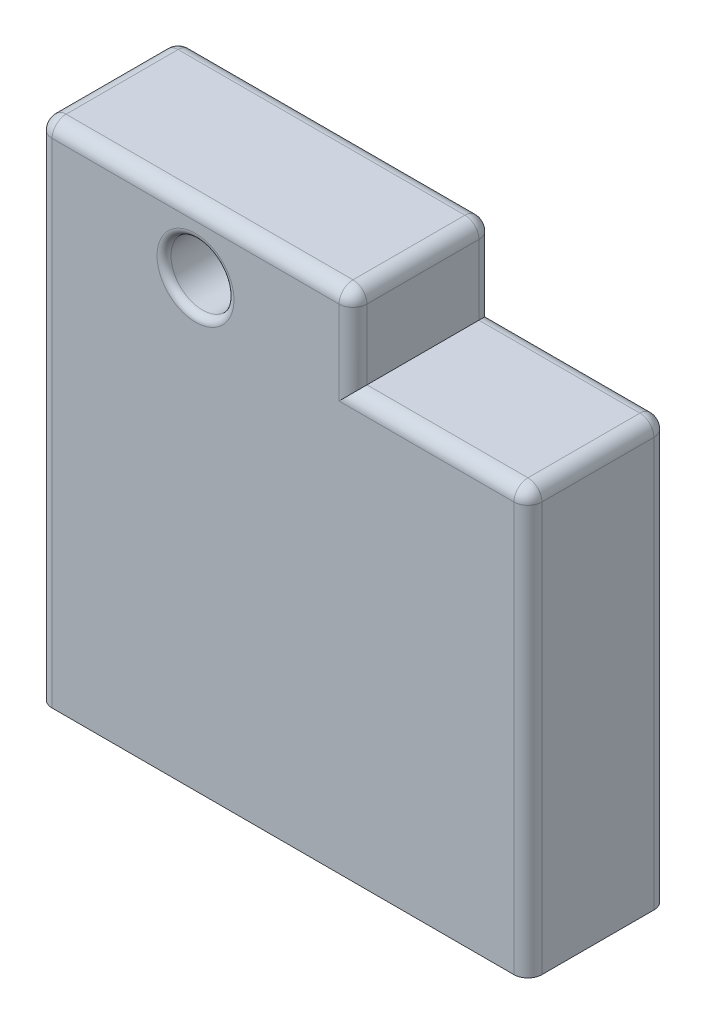
ISO-10303-21;
HEADER;
FILE_DESCRIPTION(('STEP AP214'),'2;1');
FILE_NAME('part.step','',(''),(''),'','','');
FILE_SCHEMA(('AUTOMOTIVE_DESIGN { 1 0 10303 214 1 1 1 1 }'));
ENDSEC;
DATA;
#1=APPLICATION_CONTEXT('core data for automotive mechanical design processes');
#2=APPLICATION_PROTOCOL_DEFINITION('international standard','automotive_design',2000,#1);
#3=PRODUCT_CONTEXT('',#1,'mechanical');
#4=PRODUCT('Part','Part','',(#3));
#5=PRODUCT_RELATED_PRODUCT_CATEGORY('part','',(#4));
#6=PRODUCT_DEFINITION_FORMATION('','',#4);
#7=PRODUCT_DEFINITION_CONTEXT('part definition',#1,'design');
#8=PRODUCT_DEFINITION('design','',#6,#7);
#9=PRODUCT_DEFINITION_SHAPE('','',#8);
#10=(LENGTH_UNIT() NAMED_UNIT(*) SI_UNIT(.MILLI.,.METRE.));
#11=(NAMED_UNIT(*) PLANE_ANGLE_UNIT() SI_UNIT($,.RADIAN.));
#12=(NAMED_UNIT(*) SI_UNIT($,.STERADIAN.) SOLID_ANGLE_UNIT());
#13=UNCERTAINTY_MEASURE_WITH_UNIT(LENGTH_MEASURE(1.E-05),#10,'distance_accuracy_value','');
#14=(GEOMETRIC_REPRESENTATION_CONTEXT(3) GLOBAL_UNCERTAINTY_ASSIGNED_CONTEXT((#13)) GLOBAL_UNIT_ASSIGNED_CONTEXT((#10,
#11,#12)) REPRESENTATION_CONTEXT('',''));
#15=CARTESIAN_POINT('',(0.,0.,0.));
#16=DIRECTION('',(0.,0.,1.));
#17=DIRECTION('',(1.,0.,0.));
#18=AXIS2_PLACEMENT_3D('',#15,#16,#17);
#19=CARTESIAN_POINT('',(88.9,0.,25.4));
#20=DIRECTION('',(0.,1.,0.));
#21=DIRECTION('',(0.,0.,1.));
#22=AXIS2_PLACEMENT_3D('',#19,#20,#21);
#23=PLANE('',#22);
#24=DIRECTION('',(1.,0.,0.));
#25=VECTOR('',#24,1.);
#26=CARTESIAN_POINT('',(88.9,0.,25.4));
#27=LINE('',#26,#25);
#28=CARTESIAN_POINT('',(2.54,0.,25.4));
#29=VERTEX_POINT('',#28);
#30=CARTESIAN_POINT('',(86.36,0.,25.4));
#31=VERTEX_POINT('',#30);
#32=EDGE_CURVE('E157',#29,#31,#27,.T.);
#33=ORIENTED_EDGE('',*,*,#32,.F.);
#34=CARTESIAN_POINT('',(2.54,0.,22.86));
#35=DIRECTION('',(0.,1.,0.));
#36=DIRECTION('',(0.,0.,1.));
#37=AXIS2_PLACEMENT_3D('',#34,#35,#36);
#38=CIRCLE('',#37,2.54);
#39=CARTESIAN_POINT('',(0.,0.,22.86));
#40=VERTEX_POINT('',#39);
#41=EDGE_CURVE('E169',#29,#40,#38,.F.);
#42=ORIENTED_EDGE('',*,*,#41,.T.);
#43=DIRECTION('',(0.,0.,-1.));
#44=VECTOR('',#43,1.);
#45=CARTESIAN_POINT('',(0.,0.,25.4));
#46=LINE('',#45,#44);
#47=CARTESIAN_POINT('',(0.,0.,2.54));
#48=VERTEX_POINT('',#47);
#49=EDGE_CURVE('E175',#40,#48,#46,.T.);
#50=ORIENTED_EDGE('',*,*,#49,.T.);
#51=CARTESIAN_POINT('',(2.54,0.,2.54));
#52=DIRECTION('',(0.,1.,0.));
#53=DIRECTION('',(0.,0.,1.));
#54=AXIS2_PLACEMENT_3D('',#51,#52,#53);
#55=CIRCLE('',#54,2.54);
#56=CARTESIAN_POINT('',(2.54,0.,0.));
#57=VERTEX_POINT('',#56);
#58=EDGE_CURVE('E183',#48,#57,#55,.F.);
#59=ORIENTED_EDGE('',*,*,#58,.T.);
#60=DIRECTION('',(1.,0.,0.));
#61=VECTOR('',#60,1.);
#62=CARTESIAN_POINT('',(88.9,0.,0.));
#63=LINE('',#62,#61);
#64=CARTESIAN_POINT('',(86.36,0.,0.));
#65=VERTEX_POINT('',#64);
#66=EDGE_CURVE('E176',#57,#65,#63,.T.);
#67=ORIENTED_EDGE('',*,*,#66,.T.);
#68=CARTESIAN_POINT('',(86.36,0.,2.54));
#69=DIRECTION('',(0.,1.,0.));
#70=DIRECTION('',(0.,0.,1.));
#71=AXIS2_PLACEMENT_3D('',#68,#69,#70);
#72=CIRCLE('',#71,2.54);
#73=CARTESIAN_POINT('',(88.9,0.,2.54));
#74=VERTEX_POINT('',#73);
#75=EDGE_CURVE('E189',#65,#74,#72,.F.);
#76=ORIENTED_EDGE('',*,*,#75,.T.);
#77=DIRECTION('',(0.,0.,-1.));
#78=VECTOR('',#77,1.);
#79=CARTESIAN_POINT('',(88.9,0.,25.4));
#80=LINE('',#79,#78);
#81=CARTESIAN_POINT('',(88.9,0.,22.86));
#82=VERTEX_POINT('',#81);
#83=EDGE_CURVE('E374',#82,#74,#80,.T.);
#84=ORIENTED_EDGE('',*,*,#83,.F.);
#85=CARTESIAN_POINT('',(86.36,0.,22.86));
#86=DIRECTION('',(0.,1.,0.));
#87=DIRECTION('',(0.,0.,1.));
#88=AXIS2_PLACEMENT_3D('',#85,#86,#87);
#89=CIRCLE('',#88,2.54);
#90=EDGE_CURVE('E173',#82,#31,#89,.F.);
#91=ORIENTED_EDGE('',*,*,#90,.T.);
#92=EDGE_LOOP('',(#33,#42,#50,#59,#67,#76,#84,#91));
#93=FACE_BOUND('',#92,.T.);
#94=ADVANCED_FACE('F45',(#93),#23,.F.);
#95=CARTESIAN_POINT('',(88.9,76.835,25.4));
#96=DIRECTION('',(-1.,0.,0.));
#97=DIRECTION('',(0.,-1.,0.));
#98=AXIS2_PLACEMENT_3D('',#95,#96,#97);
#99=PLANE('',#98);
#100=ORIENTED_EDGE('',*,*,#83,.T.);
#101=DIRECTION('',(0.,1.,0.));
#102=VECTOR('',#101,1.);
#103=CARTESIAN_POINT('',(88.9,76.835,2.54));
#104=LINE('',#103,#102);
#105=CARTESIAN_POINT('',(88.9,74.295,2.54));
#106=VERTEX_POINT('',#105);
#107=EDGE_CURVE('E218',#74,#106,#104,.T.);
#108=ORIENTED_EDGE('',*,*,#107,.T.);
#109=DIRECTION('',(0.,0.,-1.));
#110=VECTOR('',#109,1.);
#111=CARTESIAN_POINT('',(88.9,74.295,25.4));
#112=LINE('',#111,#110);
#113=CARTESIAN_POINT('',(88.9,74.295,22.86));
#114=VERTEX_POINT('',#113);
#115=EDGE_CURVE('E212',#106,#114,#112,.F.);
#116=ORIENTED_EDGE('',*,*,#115,.T.);
#117=DIRECTION('',(0.,1.,0.));
#118=VECTOR('',#117,1.);
#119=CARTESIAN_POINT('',(88.9,76.835,22.86));
#120=LINE('',#119,#118);
#121=EDGE_CURVE('E215',#114,#82,#120,.F.);
#122=ORIENTED_EDGE('',*,*,#121,.T.);
#123=EDGE_LOOP('',(#100,#108,#116,#122));
#124=FACE_BOUND('',#123,.T.);
#125=ADVANCED_FACE('F409',(#124),#99,.F.);
#126=CARTESIAN_POINT('',(57.15,76.835,25.4));
#127=DIRECTION('',(0.,-1.,0.));
#128=DIRECTION('',(0.,0.,-1.));
#129=AXIS2_PLACEMENT_3D('',#126,#127,#128);
#130=PLANE('',#129);
#131=DIRECTION('',(0.,0.,-1.));
#132=VECTOR('',#131,1.);
#133=CARTESIAN_POINT('',(57.15,76.835,25.4));
#134=LINE('',#133,#132);
#135=CARTESIAN_POINT('',(57.15,76.835,22.86));
#136=VERTEX_POINT('',#135);
#137=CARTESIAN_POINT('',(57.15,76.835,2.54));
#138=VERTEX_POINT('',#137);
#139=EDGE_CURVE('E369',#136,#138,#134,.T.);
#140=ORIENTED_EDGE('',*,*,#139,.F.);
#141=DIRECTION('',(-1.,0.,0.));
#142=VECTOR('',#141,1.);
#143=CARTESIAN_POINT('',(57.15,76.835,22.86));
#144=LINE('',#143,#142);
#145=CARTESIAN_POINT('',(86.36,76.835,22.86));
#146=VERTEX_POINT('',#145);
#147=EDGE_CURVE('E228',#136,#146,#144,.F.);
#148=ORIENTED_EDGE('',*,*,#147,.T.);
#149=DIRECTION('',(0.,0.,-1.));
#150=VECTOR('',#149,1.);
#151=CARTESIAN_POINT('',(86.36,76.835,25.4));
#152=LINE('',#151,#150);
#153=CARTESIAN_POINT('',(86.36,76.835,2.54));
#154=VERTEX_POINT('',#153);
#155=EDGE_CURVE('E224',#146,#154,#152,.T.);
#156=ORIENTED_EDGE('',*,*,#155,.T.);
#157=DIRECTION('',(-1.,0.,0.));
#158=VECTOR('',#157,1.);
#159=CARTESIAN_POINT('',(57.15,76.835,2.54));
#160=LINE('',#159,#158);
#161=EDGE_CURVE('E221',#154,#138,#160,.T.);
#162=ORIENTED_EDGE('',*,*,#161,.T.);
#163=EDGE_LOOP('',(#140,#148,#156,#162));
#164=FACE_BOUND('',#163,.T.);
#165=ADVANCED_FACE('F368',(#164),#130,.F.);
#166=CARTESIAN_POINT('',(57.15,92.075,25.4));
#167=DIRECTION('',(-1.,0.,0.));
#168=DIRECTION('',(0.,0.,1.));
#169=AXIS2_PLACEMENT_3D('',#166,#167,#168);
#170=PLANE('',#169);
#171=DIRECTION('',(0.,0.,-1.));
#172=VECTOR('',#171,1.);
#173=CARTESIAN_POINT('',(57.15,89.535,25.4));
#174=LINE('',#173,#172);
#175=CARTESIAN_POINT('',(57.15,89.535,2.54));
#176=VERTEX_POINT('',#175);
#177=CARTESIAN_POINT('',(57.15,89.535,22.86));
#178=VERTEX_POINT('',#177);
#179=EDGE_CURVE('E61',#176,#178,#174,.F.);
#180=ORIENTED_EDGE('',*,*,#179,.T.);
#181=DIRECTION('',(0.,1.,0.));
#182=VECTOR('',#181,1.);
#183=CARTESIAN_POINT('',(57.15,92.075,22.86));
#184=LINE('',#183,#182);
#185=EDGE_CURVE('E235',#178,#136,#184,.F.);
#186=ORIENTED_EDGE('',*,*,#185,.T.);
#187=ORIENTED_EDGE('',*,*,#139,.T.);
#188=DIRECTION('',(0.,1.,0.));
#189=VECTOR('',#188,1.);
#190=CARTESIAN_POINT('',(57.15,92.075,2.54));
#191=LINE('',#190,#189);
#192=EDGE_CURVE('E66',#138,#176,#191,.T.);
#193=ORIENTED_EDGE('',*,*,#192,.T.);
#194=EDGE_LOOP('',(#180,#186,#187,#193));
#195=FACE_BOUND('',#194,.T.);
#196=ADVANCED_FACE('F372',(#195),#170,.F.);
#197=CARTESIAN_POINT('',(0.,92.075,25.4));
#198=DIRECTION('',(0.,-1.,0.));
#199=DIRECTION('',(0.,0.,-1.));
#200=AXIS2_PLACEMENT_3D('',#197,#198,#199);
#201=PLANE('',#200);
#202=DIRECTION('',(-1.,0.,0.));
#203=VECTOR('',#202,1.);
#204=CARTESIAN_POINT('',(0.,92.075,2.54));
#205=LINE('',#204,#203);
#206=CARTESIAN_POINT('',(54.61,92.075,2.54));
#207=VERTEX_POINT('',#206);
#208=CARTESIAN_POINT('',(2.54,92.075,2.54));
#209=VERTEX_POINT('',#208);
#210=EDGE_CURVE('E396',#207,#209,#205,.T.);
#211=ORIENTED_EDGE('',*,*,#210,.T.);
#212=DIRECTION('',(0.,0.,-1.));
#213=VECTOR('',#212,1.);
#214=CARTESIAN_POINT('',(2.54,92.075,25.4));
#215=LINE('',#214,#213);
#216=CARTESIAN_POINT('',(2.54,92.075,22.86));
#217=VERTEX_POINT('',#216);
#218=EDGE_CURVE('E403',#209,#217,#215,.F.);
#219=ORIENTED_EDGE('',*,*,#218,.T.);
#220=DIRECTION('',(-1.,0.,0.));
#221=VECTOR('',#220,1.);
#222=CARTESIAN_POINT('',(0.,92.075,22.86));
#223=LINE('',#222,#221);
#224=CARTESIAN_POINT('',(54.61,92.075,22.86));
#225=VERTEX_POINT('',#224);
#226=EDGE_CURVE('E399',#217,#225,#223,.F.);
#227=ORIENTED_EDGE('',*,*,#226,.T.);
#228=DIRECTION('',(0.,0.,-1.));
#229=VECTOR('',#228,1.);
#230=CARTESIAN_POINT('',(54.61,92.075,25.4));
#231=LINE('',#230,#229);
#232=EDGE_CURVE('E165',#225,#207,#231,.T.);
#233=ORIENTED_EDGE('',*,*,#232,.T.);
#234=EDGE_LOOP('',(#211,#219,#227,#233));
#235=FACE_BOUND('',#234,.T.);
#236=ADVANCED_FACE('F468',(#235),#201,.F.);
#237=CARTESIAN_POINT('',(0.,0.,25.4));
#238=DIRECTION('',(1.,0.,0.));
#239=DIRECTION('',(0.,0.,-1.));
#240=AXIS2_PLACEMENT_3D('',#237,#238,#239);
#241=PLANE('',#240);
#242=ORIENTED_EDGE('',*,*,#49,.F.);
#243=DIRECTION('',(0.,-1.,0.));
#244=VECTOR('',#243,1.);
#245=CARTESIAN_POINT('',(0.,0.,22.86));
#246=LINE('',#245,#244);
#247=CARTESIAN_POINT('',(0.,89.535,22.86));
#248=VERTEX_POINT('',#247);
#249=EDGE_CURVE('E180',#40,#248,#246,.F.);
#250=ORIENTED_EDGE('',*,*,#249,.T.);
#251=DIRECTION('',(0.,0.,-1.));
#252=VECTOR('',#251,1.);
#253=CARTESIAN_POINT('',(0.,89.535,25.4));
#254=LINE('',#253,#252);
#255=CARTESIAN_POINT('',(0.,89.535,2.54));
#256=VERTEX_POINT('',#255);
#257=EDGE_CURVE('E182',#248,#256,#254,.T.);
#258=ORIENTED_EDGE('',*,*,#257,.T.);
#259=DIRECTION('',(0.,-1.,0.));
#260=VECTOR('',#259,1.);
#261=CARTESIAN_POINT('',(0.,0.,2.54));
#262=LINE('',#261,#260);
#263=EDGE_CURVE('E187',#256,#48,#262,.T.);
#264=ORIENTED_EDGE('',*,*,#263,.T.);
#265=EDGE_LOOP('',(#242,#250,#258,#264));
#266=FACE_BOUND('',#265,.T.);
#267=ADVANCED_FACE('F446',(#266),#241,.F.);
#268=CARTESIAN_POINT('',(0.,0.,25.4));
#269=DIRECTION('',(0.,0.,-1.));
#270=DIRECTION('',(-1.,0.,0.));
#271=AXIS2_PLACEMENT_3D('',#268,#269,#270);
#272=PLANE('',#271);
#273=CARTESIAN_POINT('',(28.5663618761285,80.645,25.4));
#274=DIRECTION('',(0.,0.,-1.));
#275=DIRECTION('',(-1.,0.,0.));
#276=AXIS2_PLACEMENT_3D('',#273,#274,#275);
#277=CIRCLE('',#276,6.98500000000002);
#278=CARTESIAN_POINT('',(21.5813618761285,80.645,25.4));
#279=VERTEX_POINT('',#278);
#280=EDGE_CURVE('E54',#279,#279,#277,.T.);
#281=ORIENTED_EDGE('',*,*,#280,.T.);
#282=EDGE_LOOP('',(#281));
#283=FACE_BOUND('',#282,.T.);
#284=DIRECTION('',(-1.,0.,0.));
#285=VECTOR('',#284,1.);
#286=CARTESIAN_POINT('',(0.,89.535,25.4));
#287=LINE('',#286,#285);
#288=CARTESIAN_POINT('',(54.61,89.535,25.4));
#289=VERTEX_POINT('',#288);
#290=CARTESIAN_POINT('',(2.54,89.535,25.4));
#291=VERTEX_POINT('',#290);
#292=EDGE_CURVE('E160',#289,#291,#287,.T.);
#293=ORIENTED_EDGE('',*,*,#292,.T.);
#294=DIRECTION('',(0.,-1.,0.));
#295=VECTOR('',#294,1.);
#296=CARTESIAN_POINT('',(2.54,0.,25.4));
#297=LINE('',#296,#295);
#298=EDGE_CURVE('E154',#291,#29,#297,.T.);
#299=ORIENTED_EDGE('',*,*,#298,.T.);
#300=ORIENTED_EDGE('',*,*,#32,.T.);
#301=DIRECTION('',(0.,1.,0.));
#302=VECTOR('',#301,1.);
#303=CARTESIAN_POINT('',(86.36,0.,25.4));
#304=LINE('',#303,#302);
#305=CARTESIAN_POINT('',(86.36,74.295,25.4));
#306=VERTEX_POINT('',#305);
#307=EDGE_CURVE('E389',#31,#306,#304,.T.);
#308=ORIENTED_EDGE('',*,*,#307,.T.);
#309=DIRECTION('',(-1.,0.,0.));
#310=VECTOR('',#309,1.);
#311=CARTESIAN_POINT('',(0.,74.295,25.4));
#312=LINE('',#311,#310);
#313=CARTESIAN_POINT('',(54.61,74.295,25.4));
#314=VERTEX_POINT('',#313);
#315=EDGE_CURVE('E386',#306,#314,#312,.T.);
#316=ORIENTED_EDGE('',*,*,#315,.T.);
#317=DIRECTION('',(0.,1.,0.));
#318=VECTOR('',#317,1.);
#319=CARTESIAN_POINT('',(54.61,0.,25.4));
#320=LINE('',#319,#318);
#321=EDGE_CURVE('E379',#314,#289,#320,.T.);
#322=ORIENTED_EDGE('',*,*,#321,.T.);
#323=EDGE_LOOP('',(#293,#299,#300,#308,#316,#322));
#324=FACE_BOUND('',#323,.T.);
#325=ADVANCED_FACE('F156',(#283,#324),#272,.F.);
#326=CARTESIAN_POINT('',(0.,0.,0.));
#327=DIRECTION('',(0.,0.,-1.));
#328=DIRECTION('',(-1.,0.,0.));
#329=AXIS2_PLACEMENT_3D('',#326,#327,#328);
#330=PLANE('',#329);
#331=CARTESIAN_POINT('',(28.5663618761285,80.645,0.));
#332=DIRECTION('',(0.,0.,-1.));
#333=DIRECTION('',(-1.,0.,0.));
#334=AXIS2_PLACEMENT_3D('',#331,#332,#333);
#335=CIRCLE('',#334,6.98500000000002);
#336=CARTESIAN_POINT('',(21.5813618761285,80.645,0.));
#337=VERTEX_POINT('',#336);
#338=EDGE_CURVE('E11',#337,#337,#335,.F.);
#339=ORIENTED_EDGE('',*,*,#338,.T.);
#340=EDGE_LOOP('',(#339));
#341=FACE_BOUND('',#340,.T.);
#342=DIRECTION('',(-1.,0.,0.));
#343=VECTOR('',#342,1.);
#344=CARTESIAN_POINT('',(88.9,74.295,0.));
#345=LINE('',#344,#343);
#346=CARTESIAN_POINT('',(54.61,74.295,0.));
#347=VERTEX_POINT('',#346);
#348=CARTESIAN_POINT('',(86.36,74.295,0.));
#349=VERTEX_POINT('',#348);
#350=EDGE_CURVE('E206',#347,#349,#345,.F.);
#351=ORIENTED_EDGE('',*,*,#350,.T.);
#352=DIRECTION('',(0.,1.,0.));
#353=VECTOR('',#352,1.);
#354=CARTESIAN_POINT('',(86.36,0.,0.));
#355=LINE('',#354,#353);
#356=EDGE_CURVE('E209',#349,#65,#355,.F.);
#357=ORIENTED_EDGE('',*,*,#356,.T.);
#358=ORIENTED_EDGE('',*,*,#66,.F.);
#359=DIRECTION('',(0.,-1.,0.));
#360=VECTOR('',#359,1.);
#361=CARTESIAN_POINT('',(2.54,92.075,0.));
#362=LINE('',#361,#360);
#363=CARTESIAN_POINT('',(2.54,89.535,0.));
#364=VERTEX_POINT('',#363);
#365=EDGE_CURVE('E203',#57,#364,#362,.F.);
#366=ORIENTED_EDGE('',*,*,#365,.T.);
#367=DIRECTION('',(-1.,0.,0.));
#368=VECTOR('',#367,1.);
#369=CARTESIAN_POINT('',(57.15,89.535,0.));
#370=LINE('',#369,#368);
#371=CARTESIAN_POINT('',(54.61,89.535,0.));
#372=VERTEX_POINT('',#371);
#373=EDGE_CURVE('E197',#364,#372,#370,.F.);
#374=ORIENTED_EDGE('',*,*,#373,.T.);
#375=DIRECTION('',(0.,1.,0.));
#376=VECTOR('',#375,1.);
#377=CARTESIAN_POINT('',(54.61,76.835,0.));
#378=LINE('',#377,#376);
#379=EDGE_CURVE('E200',#372,#347,#378,.F.);
#380=ORIENTED_EDGE('',*,*,#379,.T.);
#381=EDGE_LOOP('',(#351,#357,#358,#366,#374,#380));
#382=FACE_BOUND('',#381,.T.);
#383=ADVANCED_FACE('F338',(#341,#382),#330,.T.);
#384=CARTESIAN_POINT('',(28.5663618761285,80.645,0.));
#385=DIRECTION('',(0.,0.,1.));
#386=DIRECTION('',(1.,0.,0.));
#387=AXIS2_PLACEMENT_3D('',#384,#385,#386);
#388=CYLINDRICAL_SURFACE('',#387,5.71500000000001);
#389=CARTESIAN_POINT('',(28.5663618761285,80.645,24.13));
#390=DIRECTION('',(0.,0.,-1.));
#391=DIRECTION('',(-1.,0.,0.));
#392=AXIS2_PLACEMENT_3D('',#389,#390,#391);
#393=CIRCLE('',#392,5.71500000000001);
#394=CARTESIAN_POINT('',(22.8513618761285,80.645,24.13));
#395=VERTEX_POINT('',#394);
#396=EDGE_CURVE('E320',#395,#395,#393,.F.);
#397=ORIENTED_EDGE('',*,*,#396,.T.);
#398=EDGE_LOOP('',(#397));
#399=FACE_BOUND('',#398,.T.);
#400=CARTESIAN_POINT('',(28.5663618761285,80.645,1.27));
#401=DIRECTION('',(0.,0.,-1.));
#402=DIRECTION('',(-1.,0.,0.));
#403=AXIS2_PLACEMENT_3D('',#400,#401,#402);
#404=CIRCLE('',#403,5.71500000000001);
#405=CARTESIAN_POINT('',(22.8513618761285,80.645,1.27));
#406=VERTEX_POINT('',#405);
#407=EDGE_CURVE('E238',#406,#406,#404,.T.);
#408=ORIENTED_EDGE('',*,*,#407,.T.);
#409=EDGE_LOOP('',(#408));
#410=FACE_BOUND('',#409,.T.);
#411=ADVANCED_FACE('F334',(#399,#410),#388,.F.);
#412=CARTESIAN_POINT('',(86.36,76.835,2.54));
#413=DIRECTION('',(0.,-1.,0.));
#414=DIRECTION('',(1.,0.,0.));
#415=AXIS2_PLACEMENT_3D('',#412,#413,#414);
#416=CYLINDRICAL_SURFACE('',#415,2.54);
#417=CARTESIAN_POINT('',(86.36,74.295,2.54));
#418=DIRECTION('',(0.,1.,0.));
#419=DIRECTION('',(0.,0.,1.));
#420=AXIS2_PLACEMENT_3D('',#417,#418,#419);
#421=CIRCLE('',#420,2.54);
#422=EDGE_CURVE('E313',#106,#349,#421,.T.);
#423=ORIENTED_EDGE('',*,*,#422,.F.);
#424=ORIENTED_EDGE('',*,*,#107,.F.);
#425=ORIENTED_EDGE('',*,*,#75,.F.);
#426=ORIENTED_EDGE('',*,*,#356,.F.);
#427=EDGE_LOOP('',(#423,#424,#425,#426));
#428=FACE_BOUND('',#427,.T.);
#429=ADVANCED_FACE('F337',(#428),#416,.T.);
#430=CARTESIAN_POINT('',(86.36,74.295,2.54));
#431=DIRECTION('',(0.,0.,-1.));
#432=DIRECTION('',(-1.,0.,0.));
#433=AXIS2_PLACEMENT_3D('',#430,#431,#432);
#434=SPHERICAL_SURFACE('',#433,2.54);
#435=CARTESIAN_POINT('',(86.36,74.295,2.54));
#436=DIRECTION('',(0.,0.,-1.));
#437=DIRECTION('',(-1.,0.,0.));
#438=AXIS2_PLACEMENT_3D('',#435,#436,#437);
#439=CIRCLE('',#438,2.54);
#440=EDGE_CURVE('E305',#106,#154,#439,.F.);
#441=ORIENTED_EDGE('',*,*,#440,.F.);
#442=ORIENTED_EDGE('',*,*,#422,.T.);
#443=CARTESIAN_POINT('',(86.36,74.295,2.54));
#444=DIRECTION('',(1.,0.,0.));
#445=DIRECTION('',(0.,0.,-1.));
#446=AXIS2_PLACEMENT_3D('',#443,#444,#445);
#447=CIRCLE('',#446,2.54);
#448=EDGE_CURVE('E309',#154,#349,#447,.F.);
#449=ORIENTED_EDGE('',*,*,#448,.F.);
#450=EDGE_LOOP('',(#441,#442,#449));
#451=FACE_BOUND('',#450,.T.);
#452=ADVANCED_FACE('F363',(#451),#434,.T.);
#453=CARTESIAN_POINT('',(57.15,74.295,2.54));
#454=DIRECTION('',(1.,0.,0.));
#455=DIRECTION('',(0.,0.,-1.));
#456=AXIS2_PLACEMENT_3D('',#453,#454,#455);
#457=CYLINDRICAL_SURFACE('',#456,2.54);
#458=ORIENTED_EDGE('',*,*,#448,.T.);
#459=ORIENTED_EDGE('',*,*,#350,.F.);
#460=CARTESIAN_POINT('',(54.61,74.295,2.54));
#461=DIRECTION('',(0.707106781186547,-0.707106781186547,0.));
#462=DIRECTION('',(-0.707106781186547,-0.707106781186547,0.));
#463=AXIS2_PLACEMENT_3D('',#460,#461,#462);
#464=ELLIPSE('',#463,3.59210244842766,2.54);
#465=EDGE_CURVE('E301',#138,#347,#464,.F.);
#466=ORIENTED_EDGE('',*,*,#465,.F.);
#467=ORIENTED_EDGE('',*,*,#161,.F.);
#468=EDGE_LOOP('',(#458,#459,#466,#467));
#469=FACE_BOUND('',#468,.T.);
#470=ADVANCED_FACE('F365',(#469),#457,.T.);
#471=CARTESIAN_POINT('',(86.36,74.295,25.4));
#472=DIRECTION('',(0.,0.,-1.));
#473=DIRECTION('',(-1.,0.,0.));
#474=AXIS2_PLACEMENT_3D('',#471,#472,#473);
#475=CYLINDRICAL_SURFACE('',#474,2.54);
#476=ORIENTED_EDGE('',*,*,#440,.T.);
#477=ORIENTED_EDGE('',*,*,#155,.F.);
#478=CARTESIAN_POINT('',(86.36,74.295,22.86));
#479=DIRECTION('',(0.,0.,1.));
#480=DIRECTION('',(1.,0.,0.));
#481=AXIS2_PLACEMENT_3D('',#478,#479,#480);
#482=CIRCLE('',#481,2.54);
#483=EDGE_CURVE('E297',#114,#146,#482,.T.);
#484=ORIENTED_EDGE('',*,*,#483,.F.);
#485=ORIENTED_EDGE('',*,*,#115,.F.);
#486=EDGE_LOOP('',(#476,#477,#484,#485));
#487=FACE_BOUND('',#486,.T.);
#488=ADVANCED_FACE('F417',(#487),#475,.T.);
#489=CARTESIAN_POINT('',(86.36,0.,22.86));
#490=DIRECTION('',(0.,1.,0.));
#491=DIRECTION('',(-1.,0.,0.));
#492=AXIS2_PLACEMENT_3D('',#489,#490,#491);
#493=CYLINDRICAL_SURFACE('',#492,2.54);
#494=ORIENTED_EDGE('',*,*,#90,.F.);
#495=ORIENTED_EDGE('',*,*,#121,.F.);
#496=CARTESIAN_POINT('',(86.36,74.295,22.86));
#497=DIRECTION('',(0.,1.,0.));
#498=DIRECTION('',(0.,0.,1.));
#499=AXIS2_PLACEMENT_3D('',#496,#497,#498);
#500=CIRCLE('',#499,2.54);
#501=EDGE_CURVE('E293',#306,#114,#500,.T.);
#502=ORIENTED_EDGE('',*,*,#501,.F.);
#503=ORIENTED_EDGE('',*,*,#307,.F.);
#504=EDGE_LOOP('',(#494,#495,#502,#503));
#505=FACE_BOUND('',#504,.T.);
#506=ADVANCED_FACE('F414',(#505),#493,.T.);
#507=CARTESIAN_POINT('',(54.61,92.075,2.54));
#508=DIRECTION('',(0.,-1.,0.));
#509=DIRECTION('',(0.,0.,-1.));
#510=AXIS2_PLACEMENT_3D('',#507,#508,#509);
#511=CYLINDRICAL_SURFACE('',#510,2.54);
#512=ORIENTED_EDGE('',*,*,#465,.T.);
#513=ORIENTED_EDGE('',*,*,#379,.F.);
#514=CARTESIAN_POINT('',(54.61,89.535,2.54));
#515=DIRECTION('',(0.,1.,0.));
#516=DIRECTION('',(0.,0.,1.));
#517=AXIS2_PLACEMENT_3D('',#514,#515,#516);
#518=CIRCLE('',#517,2.54);
#519=EDGE_CURVE('E285',#176,#372,#518,.T.);
#520=ORIENTED_EDGE('',*,*,#519,.F.);
#521=ORIENTED_EDGE('',*,*,#192,.F.);
#522=EDGE_LOOP('',(#512,#513,#520,#521));
#523=FACE_BOUND('',#522,.T.);
#524=ADVANCED_FACE('F461',(#523),#511,.T.);
#525=CARTESIAN_POINT('',(86.36,74.295,22.86));
#526=DIRECTION('',(1.,0.,0.));
#527=DIRECTION('',(0.,0.,-1.));
#528=AXIS2_PLACEMENT_3D('',#525,#526,#527);
#529=SPHERICAL_SURFACE('',#528,2.54);
#530=ORIENTED_EDGE('',*,*,#501,.T.);
#531=ORIENTED_EDGE('',*,*,#483,.T.);
#532=CARTESIAN_POINT('',(86.36,74.295,22.86));
#533=DIRECTION('',(1.,0.,0.));
#534=DIRECTION('',(0.,0.,-1.));
#535=AXIS2_PLACEMENT_3D('',#532,#533,#534);
#536=CIRCLE('',#535,2.54);
#537=EDGE_CURVE('E281',#306,#146,#536,.F.);
#538=ORIENTED_EDGE('',*,*,#537,.F.);
#539=EDGE_LOOP('',(#530,#531,#538));
#540=FACE_BOUND('',#539,.T.);
#541=ADVANCED_FACE('F419',(#540),#529,.T.);
#542=CARTESIAN_POINT('',(2.54,0.,2.54));
#543=DIRECTION('',(0.,1.,0.));
#544=DIRECTION('',(0.,0.,1.));
#545=AXIS2_PLACEMENT_3D('',#542,#543,#544);
#546=CYLINDRICAL_SURFACE('',#545,2.54);
#547=ORIENTED_EDGE('',*,*,#58,.F.);
#548=ORIENTED_EDGE('',*,*,#263,.F.);
#549=CARTESIAN_POINT('',(2.54,89.535,2.54));
#550=DIRECTION('',(0.,1.,0.));
#551=DIRECTION('',(0.,0.,1.));
#552=AXIS2_PLACEMENT_3D('',#549,#550,#551);
#553=CIRCLE('',#552,2.54);
#554=EDGE_CURVE('E277',#364,#256,#553,.T.);
#555=ORIENTED_EDGE('',*,*,#554,.F.);
#556=ORIENTED_EDGE('',*,*,#365,.F.);
#557=EDGE_LOOP('',(#547,#548,#555,#556));
#558=FACE_BOUND('',#557,.T.);
#559=ADVANCED_FACE('F450',(#558),#546,.T.);
#560=CARTESIAN_POINT('',(0.,89.535,2.54));
#561=DIRECTION('',(1.,0.,0.));
#562=DIRECTION('',(0.,0.,-1.));
#563=AXIS2_PLACEMENT_3D('',#560,#561,#562);
#564=CYLINDRICAL_SURFACE('',#563,2.54);
#565=CARTESIAN_POINT('',(54.61,89.535,2.54));
#566=DIRECTION('',(1.,0.,0.));
#567=DIRECTION('',(0.,0.,-1.));
#568=AXIS2_PLACEMENT_3D('',#565,#566,#567);
#569=CIRCLE('',#568,2.54);
#570=EDGE_CURVE('E289',#372,#207,#569,.T.);
#571=ORIENTED_EDGE('',*,*,#570,.F.);
#572=ORIENTED_EDGE('',*,*,#373,.F.);
#573=CARTESIAN_POINT('',(2.54,89.535,2.54));
#574=DIRECTION('',(-1.,0.,0.));
#575=DIRECTION('',(0.,0.,1.));
#576=AXIS2_PLACEMENT_3D('',#573,#574,#575);
#577=CIRCLE('',#576,2.54);
#578=EDGE_CURVE('E273',#209,#364,#577,.T.);
#579=ORIENTED_EDGE('',*,*,#578,.F.);
#580=ORIENTED_EDGE('',*,*,#210,.F.);
#581=EDGE_LOOP('',(#571,#572,#579,#580));
#582=FACE_BOUND('',#581,.T.);
#583=ADVANCED_FACE('F459',(#582),#564,.T.);
#584=CARTESIAN_POINT('',(54.61,89.535,2.54));
#585=DIRECTION('',(0.,0.,-1.));
#586=DIRECTION('',(-1.,0.,0.));
#587=AXIS2_PLACEMENT_3D('',#584,#585,#586);
#588=SPHERICAL_SURFACE('',#587,2.54);
#589=ORIENTED_EDGE('',*,*,#519,.T.);
#590=ORIENTED_EDGE('',*,*,#570,.T.);
#591=CARTESIAN_POINT('',(54.61,89.535,2.54));
#592=DIRECTION('',(0.,0.,-1.));
#593=DIRECTION('',(-1.,0.,0.));
#594=AXIS2_PLACEMENT_3D('',#591,#592,#593);
#595=CIRCLE('',#594,2.54);
#596=EDGE_CURVE('E269',#176,#207,#595,.F.);
#597=ORIENTED_EDGE('',*,*,#596,.F.);
#598=EDGE_LOOP('',(#589,#590,#597));
#599=FACE_BOUND('',#598,.T.);
#600=ADVANCED_FACE('F464',(#599),#588,.T.);
#601=CARTESIAN_POINT('',(0.,74.295,22.86));
#602=DIRECTION('',(-1.,0.,0.));
#603=DIRECTION('',(0.,0.,1.));
#604=AXIS2_PLACEMENT_3D('',#601,#602,#603);
#605=CYLINDRICAL_SURFACE('',#604,2.54);
#606=ORIENTED_EDGE('',*,*,#537,.T.);
#607=ORIENTED_EDGE('',*,*,#147,.F.);
#608=CARTESIAN_POINT('',(54.61,74.295,22.86));
#609=DIRECTION('',(-0.707106781186547,0.707106781186547,0.));
#610=DIRECTION('',(-0.707106781186547,-0.707106781186547,0.));
#611=AXIS2_PLACEMENT_3D('',#608,#609,#610);
#612=ELLIPSE('',#611,3.59210244842766,2.54);
#613=EDGE_CURVE('E265',#314,#136,#612,.T.);
#614=ORIENTED_EDGE('',*,*,#613,.F.);
#615=ORIENTED_EDGE('',*,*,#315,.F.);
#616=EDGE_LOOP('',(#606,#607,#614,#615));
#617=FACE_BOUND('',#616,.T.);
#618=ADVANCED_FACE('F423',(#617),#605,.T.);
#619=CARTESIAN_POINT('',(2.54,89.535,2.54));
#620=DIRECTION('',(0.,0.,-1.));
#621=DIRECTION('',(-1.,0.,0.));
#622=AXIS2_PLACEMENT_3D('',#619,#620,#621);
#623=SPHERICAL_SURFACE('',#622,2.54);
#624=ORIENTED_EDGE('',*,*,#578,.T.);
#625=ORIENTED_EDGE('',*,*,#554,.T.);
#626=CARTESIAN_POINT('',(2.54,89.535,2.54));
#627=DIRECTION('',(0.,0.,-1.));
#628=DIRECTION('',(-1.,0.,0.));
#629=AXIS2_PLACEMENT_3D('',#626,#627,#628);
#630=CIRCLE('',#629,2.54);
#631=EDGE_CURVE('E261',#209,#256,#630,.F.);
#632=ORIENTED_EDGE('',*,*,#631,.F.);
#633=EDGE_LOOP('',(#624,#625,#632));
#634=FACE_BOUND('',#633,.T.);
#635=ADVANCED_FACE('F453',(#634),#623,.T.);
#636=CARTESIAN_POINT('',(54.61,89.535,25.4));
#637=DIRECTION('',(0.,0.,-1.));
#638=DIRECTION('',(-1.,0.,0.));
#639=AXIS2_PLACEMENT_3D('',#636,#637,#638);
#640=CYLINDRICAL_SURFACE('',#639,2.54);
#641=ORIENTED_EDGE('',*,*,#596,.T.);
#642=ORIENTED_EDGE('',*,*,#232,.F.);
#643=CARTESIAN_POINT('',(54.61,89.535,22.86));
#644=DIRECTION('',(0.,0.,1.));
#645=DIRECTION('',(1.,0.,0.));
#646=AXIS2_PLACEMENT_3D('',#643,#644,#645);
#647=CIRCLE('',#646,2.54);
#648=EDGE_CURVE('E257',#178,#225,#647,.T.);
#649=ORIENTED_EDGE('',*,*,#648,.F.);
#650=ORIENTED_EDGE('',*,*,#179,.F.);
#651=EDGE_LOOP('',(#641,#642,#649,#650));
#652=FACE_BOUND('',#651,.T.);
#653=ADVANCED_FACE('F466',(#652),#640,.T.);
#654=CARTESIAN_POINT('',(54.61,0.,22.86));
#655=DIRECTION('',(0.,1.,0.));
#656=DIRECTION('',(0.,0.,1.));
#657=AXIS2_PLACEMENT_3D('',#654,#655,#656);
#658=CYLINDRICAL_SURFACE('',#657,2.54);
#659=ORIENTED_EDGE('',*,*,#613,.T.);
#660=ORIENTED_EDGE('',*,*,#185,.F.);
#661=CARTESIAN_POINT('',(54.61,89.535,22.86));
#662=DIRECTION('',(0.,1.,0.));
#663=DIRECTION('',(0.,0.,1.));
#664=AXIS2_PLACEMENT_3D('',#661,#662,#663);
#665=CIRCLE('',#664,2.54);
#666=EDGE_CURVE('E253',#289,#178,#665,.T.);
#667=ORIENTED_EDGE('',*,*,#666,.F.);
#668=ORIENTED_EDGE('',*,*,#321,.F.);
#669=EDGE_LOOP('',(#659,#660,#667,#668));
#670=FACE_BOUND('',#669,.T.);
#671=ADVANCED_FACE('F428',(#670),#658,.T.);
#672=CARTESIAN_POINT('',(2.54,0.,22.86));
#673=DIRECTION('',(0.,-1.,0.));
#674=DIRECTION('',(0.,0.,-1.));
#675=AXIS2_PLACEMENT_3D('',#672,#673,#674);
#676=CYLINDRICAL_SURFACE('',#675,2.54);
#677=ORIENTED_EDGE('',*,*,#41,.F.);
#678=ORIENTED_EDGE('',*,*,#298,.F.);
#679=CARTESIAN_POINT('',(2.54,89.535,22.86));
#680=DIRECTION('',(0.,1.,0.));
#681=DIRECTION('',(0.,0.,1.));
#682=AXIS2_PLACEMENT_3D('',#679,#680,#681);
#683=CIRCLE('',#682,2.54);
#684=EDGE_CURVE('E249',#248,#291,#683,.T.);
#685=ORIENTED_EDGE('',*,*,#684,.F.);
#686=ORIENTED_EDGE('',*,*,#249,.F.);
#687=EDGE_LOOP('',(#677,#678,#685,#686));
#688=FACE_BOUND('',#687,.T.);
#689=ADVANCED_FACE('F179',(#688),#676,.T.);
#690=CARTESIAN_POINT('',(2.54,89.535,25.4));
#691=DIRECTION('',(0.,0.,-1.));
#692=DIRECTION('',(-1.,0.,0.));
#693=AXIS2_PLACEMENT_3D('',#690,#691,#692);
#694=CYLINDRICAL_SURFACE('',#693,2.54);
#695=ORIENTED_EDGE('',*,*,#631,.T.);
#696=ORIENTED_EDGE('',*,*,#257,.F.);
#697=CARTESIAN_POINT('',(2.54,89.535,22.86));
#698=DIRECTION('',(0.,0.,1.));
#699=DIRECTION('',(1.,0.,0.));
#700=AXIS2_PLACEMENT_3D('',#697,#698,#699);
#701=CIRCLE('',#700,2.54);
#702=EDGE_CURVE('E245',#217,#248,#701,.T.);
#703=ORIENTED_EDGE('',*,*,#702,.F.);
#704=ORIENTED_EDGE('',*,*,#218,.F.);
#705=EDGE_LOOP('',(#695,#696,#703,#704));
#706=FACE_BOUND('',#705,.T.);
#707=ADVANCED_FACE('F442',(#706),#694,.T.);
#708=CARTESIAN_POINT('',(54.61,89.535,22.86));
#709=DIRECTION('',(1.,0.,0.));
#710=DIRECTION('',(0.,0.,-1.));
#711=AXIS2_PLACEMENT_3D('',#708,#709,#710);
#712=SPHERICAL_SURFACE('',#711,2.54);
#713=ORIENTED_EDGE('',*,*,#666,.T.);
#714=ORIENTED_EDGE('',*,*,#648,.T.);
#715=CARTESIAN_POINT('',(54.61,89.535,22.86));
#716=DIRECTION('',(1.,0.,0.));
#717=DIRECTION('',(0.,0.,-1.));
#718=AXIS2_PLACEMENT_3D('',#715,#716,#717);
#719=CIRCLE('',#718,2.54);
#720=EDGE_CURVE('E242',#289,#225,#719,.F.);
#721=ORIENTED_EDGE('',*,*,#720,.F.);
#722=EDGE_LOOP('',(#713,#714,#721));
#723=FACE_BOUND('',#722,.T.);
#724=ADVANCED_FACE('F431',(#723),#712,.T.);
#725=CARTESIAN_POINT('',(2.54,89.535,22.86));
#726=DIRECTION('',(-1.,0.,0.));
#727=DIRECTION('',(0.,0.,1.));
#728=AXIS2_PLACEMENT_3D('',#725,#726,#727);
#729=SPHERICAL_SURFACE('',#728,2.54);
#730=ORIENTED_EDGE('',*,*,#702,.T.);
#731=ORIENTED_EDGE('',*,*,#684,.T.);
#732=CARTESIAN_POINT('',(2.54,89.535,22.86));
#733=DIRECTION('',(-1.,0.,0.));
#734=DIRECTION('',(0.,0.,1.));
#735=AXIS2_PLACEMENT_3D('',#732,#733,#734);
#736=CIRCLE('',#735,2.54);
#737=EDGE_CURVE('E239',#217,#291,#736,.F.);
#738=ORIENTED_EDGE('',*,*,#737,.F.);
#739=EDGE_LOOP('',(#730,#731,#738));
#740=FACE_BOUND('',#739,.T.);
#741=ADVANCED_FACE('F437',(#740),#729,.T.);
#742=CARTESIAN_POINT('',(0.,89.535,22.86));
#743=DIRECTION('',(-1.,0.,0.));
#744=DIRECTION('',(0.,0.,1.));
#745=AXIS2_PLACEMENT_3D('',#742,#743,#744);
#746=CYLINDRICAL_SURFACE('',#745,2.54);
#747=ORIENTED_EDGE('',*,*,#720,.T.);
#748=ORIENTED_EDGE('',*,*,#226,.F.);
#749=ORIENTED_EDGE('',*,*,#737,.T.);
#750=ORIENTED_EDGE('',*,*,#292,.F.);
#751=EDGE_LOOP('',(#747,#748,#749,#750));
#752=FACE_BOUND('',#751,.T.);
#753=ADVANCED_FACE('F331',(#752),#746,.T.);
#754=CARTESIAN_POINT('',(28.5663618761285,80.645,24.13));
#755=DIRECTION('',(0.,0.,-1.));
#756=DIRECTION('',(-1.,0.,0.));
#757=AXIS2_PLACEMENT_3D('',#754,#755,#756);
#758=TOROIDAL_SURFACE('',#757,6.98500000000002,1.27);
#759=ORIENTED_EDGE('',*,*,#280,.F.);
#760=EDGE_LOOP('',(#759));
#761=FACE_BOUND('',#760,.T.);
#762=ORIENTED_EDGE('',*,*,#396,.F.);
#763=EDGE_LOOP('',(#762));
#764=FACE_BOUND('',#763,.T.);
#765=ADVANCED_FACE('F328',(#761,#764),#758,.T.);
#766=CARTESIAN_POINT('',(28.5663618761285,80.645,1.27));
#767=DIRECTION('',(0.,0.,-1.));
#768=DIRECTION('',(-1.,0.,0.));
#769=AXIS2_PLACEMENT_3D('',#766,#767,#768);
#770=TOROIDAL_SURFACE('',#769,6.98500000000002,1.27);
#771=ORIENTED_EDGE('',*,*,#407,.F.);
#772=EDGE_LOOP('',(#771));
#773=FACE_BOUND('',#772,.T.);
#774=ORIENTED_EDGE('',*,*,#338,.F.);
#775=EDGE_LOOP('',(#774));
#776=FACE_BOUND('',#775,.T.);
#777=ADVANCED_FACE('F47',(#773,#776),#770,.T.);
#778=CLOSED_SHELL('',(#94,#125,#165,#196,#236,#267,#325,#383,#411,#429,#452,#470,#488,#506,#524,
#541,#559,#583,#600,#618,#635,#653,#671,#689,#707,#724,#741,#753,#765,#777));
#779=MANIFOLD_SOLID_BREP('B2',#778);
#780=ADVANCED_BREP_SHAPE_REPRESENTATION('',(#18,#779),#14);
#781=SHAPE_DEFINITION_REPRESENTATION(#9,#780);
ENDSEC;
END-ISO-10303-21;
